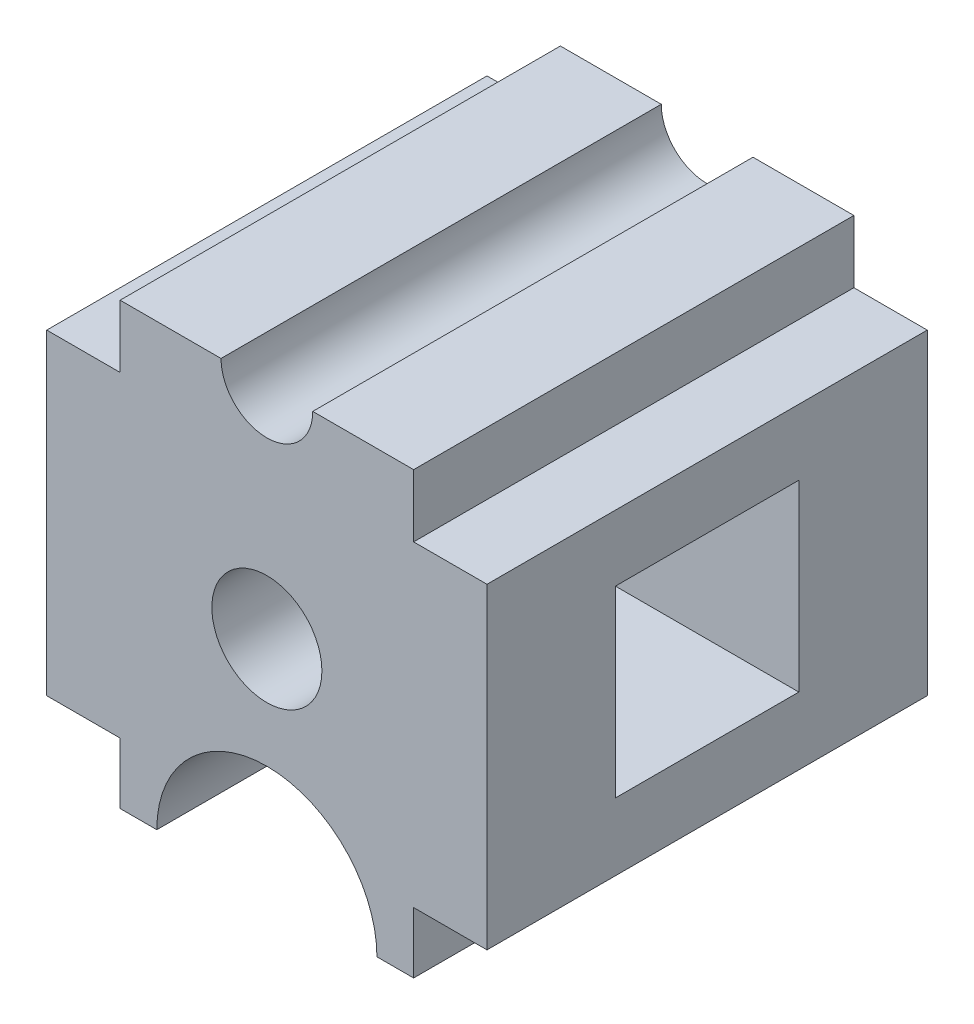
ISO-10303-21;
HEADER;
FILE_DESCRIPTION(('STEP AP214'),'2;1');
FILE_NAME('part.step','',(''),(''),'','','');
FILE_SCHEMA(('AUTOMOTIVE_DESIGN { 1 0 10303 214 1 1 1 1 }'));
ENDSEC;
DATA;
#1=APPLICATION_CONTEXT('core data for automotive mechanical design processes');
#2=APPLICATION_PROTOCOL_DEFINITION('international standard','automotive_design',2000,#1);
#3=PRODUCT_CONTEXT('',#1,'mechanical');
#4=PRODUCT('Part','Part','',(#3));
#5=PRODUCT_RELATED_PRODUCT_CATEGORY('part','',(#4));
#6=PRODUCT_DEFINITION_FORMATION('','',#4);
#7=PRODUCT_DEFINITION_CONTEXT('part definition',#1,'design');
#8=PRODUCT_DEFINITION('design','',#6,#7);
#9=PRODUCT_DEFINITION_SHAPE('','',#8);
#10=(LENGTH_UNIT() NAMED_UNIT(*) SI_UNIT(.MILLI.,.METRE.));
#11=(NAMED_UNIT(*) PLANE_ANGLE_UNIT() SI_UNIT($,.RADIAN.));
#12=(NAMED_UNIT(*) SI_UNIT($,.STERADIAN.) SOLID_ANGLE_UNIT());
#13=UNCERTAINTY_MEASURE_WITH_UNIT(LENGTH_MEASURE(1.E-05),#10,'distance_accuracy_value','');
#14=(GEOMETRIC_REPRESENTATION_CONTEXT(3) GLOBAL_UNCERTAINTY_ASSIGNED_CONTEXT((#13)) GLOBAL_UNIT_ASSIGNED_CONTEXT((#10,
#11,#12)) REPRESENTATION_CONTEXT('',''));
#15=CARTESIAN_POINT('',(0.,0.,0.));
#16=DIRECTION('',(0.,0.,1.));
#17=DIRECTION('',(1.,0.,0.));
#18=AXIS2_PLACEMENT_3D('',#15,#16,#17);
#19=CARTESIAN_POINT('',(0.,0.,60.));
#20=DIRECTION('',(0.,0.,-1.));
#21=DIRECTION('',(-1.,0.,0.));
#22=AXIS2_PLACEMENT_3D('',#19,#20,#21);
#23=CYLINDRICAL_SURFACE('',#22,15.);
#24=CARTESIAN_POINT('',(0.,0.,-25.));
#25=DIRECTION('',(0.,0.,-1.));
#26=DIRECTION('',(-1.,0.,0.));
#27=AXIS2_PLACEMENT_3D('',#24,#25,#26);
#28=CIRCLE('',#27,15.);
#29=CARTESIAN_POINT('',(-15.,0.,-25.));
#30=VERTEX_POINT('',#29);
#31=EDGE_CURVE('E37',#30,#30,#28,.T.);
#32=ORIENTED_EDGE('',*,*,#31,.F.);
#33=EDGE_LOOP('',(#32));
#34=FACE_BOUND('',#33,.T.);
#35=CARTESIAN_POINT('',(0.,0.,-60.));
#36=DIRECTION('',(0.,0.,1.));
#37=DIRECTION('',(1.,0.,0.));
#38=AXIS2_PLACEMENT_3D('',#35,#36,#37);
#39=CIRCLE('',#38,15.);
#40=CARTESIAN_POINT('',(15.,0.,-60.));
#41=VERTEX_POINT('',#40);
#42=EDGE_CURVE('E213',#41,#41,#39,.T.);
#43=ORIENTED_EDGE('',*,*,#42,.F.);
#44=EDGE_LOOP('',(#43));
#45=FACE_BOUND('',#44,.T.);
#46=ADVANCED_FACE('F33',(#34,#45),#23,.F.);
#47=CARTESIAN_POINT('',(0.,-60.,60.));
#48=DIRECTION('',(0.,0.,1.));
#49=DIRECTION('',(1.,0.,0.));
#50=AXIS2_PLACEMENT_3D('',#47,#48,#49);
#51=PLANE('',#50);
#52=CARTESIAN_POINT('',(0.,-60.,60.));
#53=DIRECTION('',(0.,0.,-1.));
#54=DIRECTION('',(1.,0.,0.));
#55=AXIS2_PLACEMENT_3D('',#52,#53,#54);
#56=CIRCLE('',#55,30.);
#57=CARTESIAN_POINT('',(-30.,-60.,60.));
#58=VERTEX_POINT('',#57);
#59=CARTESIAN_POINT('',(30.,-60.,60.));
#60=VERTEX_POINT('',#59);
#61=EDGE_CURVE('E216',#58,#60,#56,.T.);
#62=ORIENTED_EDGE('',*,*,#61,.T.);
#63=DIRECTION('',(1.,0.,0.));
#64=VECTOR('',#63,1.);
#65=CARTESIAN_POINT('',(30.,-60.,60.));
#66=LINE('',#65,#64);
#67=CARTESIAN_POINT('',(40.0000000000001,-60.,60.));
#68=VERTEX_POINT('',#67);
#69=EDGE_CURVE('E219',#60,#68,#66,.T.);
#70=ORIENTED_EDGE('',*,*,#69,.T.);
#71=DIRECTION('',(0.,1.,0.));
#72=VECTOR('',#71,1.);
#73=CARTESIAN_POINT('',(40.0000000000001,-60.,60.));
#74=LINE('',#73,#72);
#75=CARTESIAN_POINT('',(40.0000000000001,-43.3694035710161,60.));
#76=VERTEX_POINT('',#75);
#77=EDGE_CURVE('E222',#68,#76,#74,.T.);
#78=ORIENTED_EDGE('',*,*,#77,.T.);
#79=DIRECTION('',(1.,0.,0.));
#80=VECTOR('',#79,1.);
#81=CARTESIAN_POINT('',(40.0000000000001,-43.3694035710161,60.));
#82=LINE('',#81,#80);
#83=CARTESIAN_POINT('',(60.,-43.3694035710161,60.));
#84=VERTEX_POINT('',#83);
#85=EDGE_CURVE('E224',#76,#84,#82,.T.);
#86=ORIENTED_EDGE('',*,*,#85,.T.);
#87=DIRECTION('',(0.,1.,0.));
#88=VECTOR('',#87,1.);
#89=CARTESIAN_POINT('',(60.,-43.3694035710161,60.));
#90=LINE('',#89,#88);
#91=CARTESIAN_POINT('',(60.,42.9425776749978,60.));
#92=VERTEX_POINT('',#91);
#93=EDGE_CURVE('E226',#84,#92,#90,.T.);
#94=ORIENTED_EDGE('',*,*,#93,.T.);
#95=DIRECTION('',(-1.,0.,0.));
#96=VECTOR('',#95,1.);
#97=CARTESIAN_POINT('',(60.,42.9425776749978,60.));
#98=LINE('',#97,#96);
#99=CARTESIAN_POINT('',(40.,42.9425776749978,60.));
#100=VERTEX_POINT('',#99);
#101=EDGE_CURVE('E228',#92,#100,#98,.T.);
#102=ORIENTED_EDGE('',*,*,#101,.T.);
#103=DIRECTION('',(0.,1.,0.));
#104=VECTOR('',#103,1.);
#105=CARTESIAN_POINT('',(40.,42.9425776749978,60.));
#106=LINE('',#105,#104);
#107=CARTESIAN_POINT('',(40.,60.,60.));
#108=VERTEX_POINT('',#107);
#109=EDGE_CURVE('E230',#100,#108,#106,.T.);
#110=ORIENTED_EDGE('',*,*,#109,.T.);
#111=DIRECTION('',(-1.,0.,0.));
#112=VECTOR('',#111,1.);
#113=CARTESIAN_POINT('',(40.,60.,60.));
#114=LINE('',#113,#112);
#115=CARTESIAN_POINT('',(12.5,60.,60.));
#116=VERTEX_POINT('',#115);
#117=EDGE_CURVE('E232',#108,#116,#114,.T.);
#118=ORIENTED_EDGE('',*,*,#117,.T.);
#119=CARTESIAN_POINT('',(0.,60.,60.));
#120=DIRECTION('',(0.,0.,-1.));
#121=DIRECTION('',(1.,0.,0.));
#122=AXIS2_PLACEMENT_3D('',#119,#120,#121);
#123=CIRCLE('',#122,12.5);
#124=CARTESIAN_POINT('',(-12.5,60.,60.));
#125=VERTEX_POINT('',#124);
#126=EDGE_CURVE('E234',#116,#125,#123,.T.);
#127=ORIENTED_EDGE('',*,*,#126,.T.);
#128=DIRECTION('',(-1.,0.,0.));
#129=VECTOR('',#128,1.);
#130=CARTESIAN_POINT('',(-12.5,60.,60.));
#131=LINE('',#130,#129);
#132=CARTESIAN_POINT('',(-40.,60.,60.));
#133=VERTEX_POINT('',#132);
#134=EDGE_CURVE('E236',#125,#133,#131,.T.);
#135=ORIENTED_EDGE('',*,*,#134,.T.);
#136=DIRECTION('',(0.,-1.,0.));
#137=VECTOR('',#136,1.);
#138=CARTESIAN_POINT('',(-40.,60.,60.));
#139=LINE('',#138,#137);
#140=CARTESIAN_POINT('',(-40.,42.9425776749978,60.));
#141=VERTEX_POINT('',#140);
#142=EDGE_CURVE('E238',#133,#141,#139,.T.);
#143=ORIENTED_EDGE('',*,*,#142,.T.);
#144=DIRECTION('',(-1.,0.,0.));
#145=VECTOR('',#144,1.);
#146=CARTESIAN_POINT('',(-40.,42.9425776749978,60.));
#147=LINE('',#146,#145);
#148=CARTESIAN_POINT('',(-60.,42.9425776749978,60.));
#149=VERTEX_POINT('',#148);
#150=EDGE_CURVE('E240',#141,#149,#147,.T.);
#151=ORIENTED_EDGE('',*,*,#150,.T.);
#152=DIRECTION('',(0.,-1.,0.));
#153=VECTOR('',#152,1.);
#154=CARTESIAN_POINT('',(-60.,42.9425776749978,60.));
#155=LINE('',#154,#153);
#156=CARTESIAN_POINT('',(-60.,-43.3694035710161,60.));
#157=VERTEX_POINT('',#156);
#158=EDGE_CURVE('E242',#149,#157,#155,.T.);
#159=ORIENTED_EDGE('',*,*,#158,.T.);
#160=DIRECTION('',(1.,0.,0.));
#161=VECTOR('',#160,1.);
#162=CARTESIAN_POINT('',(-60.,-43.3694035710161,60.));
#163=LINE('',#162,#161);
#164=CARTESIAN_POINT('',(-40.,-43.3694035710161,60.));
#165=VERTEX_POINT('',#164);
#166=EDGE_CURVE('E244',#157,#165,#163,.T.);
#167=ORIENTED_EDGE('',*,*,#166,.T.);
#168=DIRECTION('',(0.,-1.,0.));
#169=VECTOR('',#168,1.);
#170=CARTESIAN_POINT('',(-40.,-43.3694035710161,60.));
#171=LINE('',#170,#169);
#172=CARTESIAN_POINT('',(-40.,-60.,60.));
#173=VERTEX_POINT('',#172);
#174=EDGE_CURVE('E246',#165,#173,#171,.T.);
#175=ORIENTED_EDGE('',*,*,#174,.T.);
#176=DIRECTION('',(1.,0.,0.));
#177=VECTOR('',#176,1.);
#178=CARTESIAN_POINT('',(-40.,-60.,60.));
#179=LINE('',#178,#177);
#180=EDGE_CURVE('E248',#173,#58,#179,.T.);
#181=ORIENTED_EDGE('',*,*,#180,.T.);
#182=EDGE_LOOP('',(#62,#70,#78,#86,#94,#102,#110,#118,#127,#135,#143,#151,#159,#167,#175,#181));
#183=FACE_BOUND('',#182,.T.);
#184=CARTESIAN_POINT('',(0.,0.,60.));
#185=DIRECTION('',(0.,0.,1.));
#186=DIRECTION('',(1.,0.,0.));
#187=AXIS2_PLACEMENT_3D('',#184,#185,#186);
#188=CIRCLE('',#187,15.);
#189=CARTESIAN_POINT('',(15.,0.,60.));
#190=VERTEX_POINT('',#189);
#191=EDGE_CURVE('E209',#190,#190,#188,.T.);
#192=ORIENTED_EDGE('',*,*,#191,.F.);
#193=EDGE_LOOP('',(#192));
#194=FACE_BOUND('',#193,.T.);
#195=ADVANCED_FACE('F334',(#183,#194),#51,.T.);
#196=CARTESIAN_POINT('',(0.,-60.,-60.));
#197=DIRECTION('',(0.,0.,1.));
#198=DIRECTION('',(1.,0.,0.));
#199=AXIS2_PLACEMENT_3D('',#196,#197,#198);
#200=PLANE('',#199);
#201=CARTESIAN_POINT('',(0.,-60.,-60.));
#202=DIRECTION('',(0.,0.,-1.));
#203=DIRECTION('',(1.,0.,0.));
#204=AXIS2_PLACEMENT_3D('',#201,#202,#203);
#205=CIRCLE('',#204,30.);
#206=CARTESIAN_POINT('',(-30.,-60.,-60.));
#207=VERTEX_POINT('',#206);
#208=CARTESIAN_POINT('',(30.,-60.,-60.));
#209=VERTEX_POINT('',#208);
#210=EDGE_CURVE('E212',#207,#209,#205,.T.);
#211=ORIENTED_EDGE('',*,*,#210,.F.);
#212=DIRECTION('',(1.,0.,0.));
#213=VECTOR('',#212,1.);
#214=CARTESIAN_POINT('',(-40.,-60.,-60.));
#215=LINE('',#214,#213);
#216=CARTESIAN_POINT('',(-40.,-60.,-60.));
#217=VERTEX_POINT('',#216);
#218=EDGE_CURVE('E220',#217,#207,#215,.T.);
#219=ORIENTED_EDGE('',*,*,#218,.F.);
#220=DIRECTION('',(0.,-1.,0.));
#221=VECTOR('',#220,1.);
#222=CARTESIAN_POINT('',(-40.,-43.3694035710161,-60.));
#223=LINE('',#222,#221);
#224=CARTESIAN_POINT('',(-40.,-43.3694035710161,-60.));
#225=VERTEX_POINT('',#224);
#226=EDGE_CURVE('E280',#225,#217,#223,.T.);
#227=ORIENTED_EDGE('',*,*,#226,.F.);
#228=DIRECTION('',(1.,0.,0.));
#229=VECTOR('',#228,1.);
#230=CARTESIAN_POINT('',(-60.,-43.3694035710161,-60.));
#231=LINE('',#230,#229);
#232=CARTESIAN_POINT('',(-60.,-43.3694035710161,-60.));
#233=VERTEX_POINT('',#232);
#234=EDGE_CURVE('E278',#233,#225,#231,.T.);
#235=ORIENTED_EDGE('',*,*,#234,.F.);
#236=DIRECTION('',(0.,-1.,0.));
#237=VECTOR('',#236,1.);
#238=CARTESIAN_POINT('',(-60.,0.,-60.));
#239=LINE('',#238,#237);
#240=CARTESIAN_POINT('',(-60.,42.9425776749978,-60.));
#241=VERTEX_POINT('',#240);
#242=EDGE_CURVE('E276',#241,#233,#239,.T.);
#243=ORIENTED_EDGE('',*,*,#242,.F.);
#244=DIRECTION('',(-1.,0.,0.));
#245=VECTOR('',#244,1.);
#246=CARTESIAN_POINT('',(-40.,42.9425776749978,-60.));
#247=LINE('',#246,#245);
#248=CARTESIAN_POINT('',(-40.,42.9425776749978,-60.));
#249=VERTEX_POINT('',#248);
#250=EDGE_CURVE('E273',#249,#241,#247,.T.);
#251=ORIENTED_EDGE('',*,*,#250,.F.);
#252=DIRECTION('',(0.,-1.,0.));
#253=VECTOR('',#252,1.);
#254=CARTESIAN_POINT('',(-40.,60.,-60.));
#255=LINE('',#254,#253);
#256=CARTESIAN_POINT('',(-40.,60.,-60.));
#257=VERTEX_POINT('',#256);
#258=EDGE_CURVE('E271',#257,#249,#255,.T.);
#259=ORIENTED_EDGE('',*,*,#258,.F.);
#260=DIRECTION('',(-1.,0.,0.));
#261=VECTOR('',#260,1.);
#262=CARTESIAN_POINT('',(-12.5,60.,-60.));
#263=LINE('',#262,#261);
#264=CARTESIAN_POINT('',(-12.5,60.,-60.));
#265=VERTEX_POINT('',#264);
#266=EDGE_CURVE('E269',#265,#257,#263,.T.);
#267=ORIENTED_EDGE('',*,*,#266,.F.);
#268=CARTESIAN_POINT('',(0.,60.,-60.));
#269=DIRECTION('',(0.,0.,-1.));
#270=DIRECTION('',(1.,0.,0.));
#271=AXIS2_PLACEMENT_3D('',#268,#269,#270);
#272=CIRCLE('',#271,12.5);
#273=CARTESIAN_POINT('',(12.5,60.,-60.));
#274=VERTEX_POINT('',#273);
#275=EDGE_CURVE('E267',#274,#265,#272,.T.);
#276=ORIENTED_EDGE('',*,*,#275,.F.);
#277=DIRECTION('',(-1.,0.,0.));
#278=VECTOR('',#277,1.);
#279=CARTESIAN_POINT('',(40.,60.,-60.));
#280=LINE('',#279,#278);
#281=CARTESIAN_POINT('',(40.,60.,-60.));
#282=VERTEX_POINT('',#281);
#283=EDGE_CURVE('E265',#282,#274,#280,.T.);
#284=ORIENTED_EDGE('',*,*,#283,.F.);
#285=DIRECTION('',(0.,1.,0.));
#286=VECTOR('',#285,1.);
#287=CARTESIAN_POINT('',(40.,42.9425776749978,-60.));
#288=LINE('',#287,#286);
#289=CARTESIAN_POINT('',(40.,42.9425776749978,-60.));
#290=VERTEX_POINT('',#289);
#291=EDGE_CURVE('E263',#290,#282,#288,.T.);
#292=ORIENTED_EDGE('',*,*,#291,.F.);
#293=DIRECTION('',(-1.,0.,0.));
#294=VECTOR('',#293,1.);
#295=CARTESIAN_POINT('',(60.,42.9425776749978,-60.));
#296=LINE('',#295,#294);
#297=CARTESIAN_POINT('',(60.,42.9425776749978,-60.));
#298=VERTEX_POINT('',#297);
#299=EDGE_CURVE('E261',#298,#290,#296,.T.);
#300=ORIENTED_EDGE('',*,*,#299,.F.);
#301=DIRECTION('',(0.,1.,0.));
#302=VECTOR('',#301,1.);
#303=CARTESIAN_POINT('',(60.,-43.3694035710161,-60.));
#304=LINE('',#303,#302);
#305=CARTESIAN_POINT('',(60.,-43.3694035710161,-60.));
#306=VERTEX_POINT('',#305);
#307=EDGE_CURVE('E259',#306,#298,#304,.T.);
#308=ORIENTED_EDGE('',*,*,#307,.F.);
#309=DIRECTION('',(1.,0.,0.));
#310=VECTOR('',#309,1.);
#311=CARTESIAN_POINT('',(40.0000000000001,-43.3694035710161,-60.));
#312=LINE('',#311,#310);
#313=CARTESIAN_POINT('',(40.0000000000001,-43.3694035710161,-60.));
#314=VERTEX_POINT('',#313);
#315=EDGE_CURVE('E257',#314,#306,#312,.T.);
#316=ORIENTED_EDGE('',*,*,#315,.F.);
#317=DIRECTION('',(0.,1.,0.));
#318=VECTOR('',#317,1.);
#319=CARTESIAN_POINT('',(40.0000000000001,-60.,-60.));
#320=LINE('',#319,#318);
#321=CARTESIAN_POINT('',(40.0000000000001,-60.,-60.));
#322=VERTEX_POINT('',#321);
#323=EDGE_CURVE('E255',#322,#314,#320,.T.);
#324=ORIENTED_EDGE('',*,*,#323,.F.);
#325=DIRECTION('',(1.,0.,0.));
#326=VECTOR('',#325,1.);
#327=CARTESIAN_POINT('',(30.,-60.,-60.));
#328=LINE('',#327,#326);
#329=EDGE_CURVE('E253',#209,#322,#328,.T.);
#330=ORIENTED_EDGE('',*,*,#329,.F.);
#331=EDGE_LOOP('',(#211,#219,#227,#235,#243,#251,#259,#267,#276,#284,#292,#300,#308,#316,#324,#330));
#332=FACE_BOUND('',#331,.T.);
#333=ORIENTED_EDGE('',*,*,#42,.T.);
#334=EDGE_LOOP('',(#333));
#335=FACE_BOUND('',#334,.T.);
#336=ADVANCED_FACE('F339',(#332,#335),#200,.F.);
#337=CARTESIAN_POINT('',(0.,-60.,60.));
#338=DIRECTION('',(0.,0.,-1.));
#339=DIRECTION('',(-1.,0.,0.));
#340=AXIS2_PLACEMENT_3D('',#337,#338,#339);
#341=CYLINDRICAL_SURFACE('',#340,30.);
#342=ORIENTED_EDGE('',*,*,#210,.T.);
#343=DIRECTION('',(0.,0.,-1.));
#344=VECTOR('',#343,1.);
#345=CARTESIAN_POINT('',(30.,-60.,60.));
#346=LINE('',#345,#344);
#347=EDGE_CURVE('E11',#60,#209,#346,.T.);
#348=ORIENTED_EDGE('',*,*,#347,.F.);
#349=ORIENTED_EDGE('',*,*,#61,.F.);
#350=DIRECTION('',(0.,0.,-1.));
#351=VECTOR('',#350,1.);
#352=CARTESIAN_POINT('',(-30.,-60.,60.));
#353=LINE('',#352,#351);
#354=EDGE_CURVE('E250',#58,#207,#353,.T.);
#355=ORIENTED_EDGE('',*,*,#354,.T.);
#356=EDGE_LOOP('',(#342,#348,#349,#355));
#357=FACE_BOUND('',#356,.T.);
#358=ADVANCED_FACE('F35',(#357),#341,.F.);
#359=CARTESIAN_POINT('',(30.,-60.,60.));
#360=DIRECTION('',(0.,1.,0.));
#361=DIRECTION('',(0.,0.,1.));
#362=AXIS2_PLACEMENT_3D('',#359,#360,#361);
#363=PLANE('',#362);
#364=ORIENTED_EDGE('',*,*,#329,.T.);
#365=DIRECTION('',(0.,0.,-1.));
#366=VECTOR('',#365,1.);
#367=CARTESIAN_POINT('',(40.0000000000001,-60.,60.));
#368=LINE('',#367,#366);
#369=EDGE_CURVE('E42',#68,#322,#368,.T.);
#370=ORIENTED_EDGE('',*,*,#369,.F.);
#371=ORIENTED_EDGE('',*,*,#69,.F.);
#372=ORIENTED_EDGE('',*,*,#347,.T.);
#373=EDGE_LOOP('',(#364,#370,#371,#372));
#374=FACE_BOUND('',#373,.T.);
#375=ADVANCED_FACE('F347',(#374),#363,.F.);
#376=CARTESIAN_POINT('',(40.0000000000001,-60.,60.));
#377=DIRECTION('',(-1.,0.,0.));
#378=DIRECTION('',(0.,0.,1.));
#379=AXIS2_PLACEMENT_3D('',#376,#377,#378);
#380=PLANE('',#379);
#381=ORIENTED_EDGE('',*,*,#323,.T.);
#382=DIRECTION('',(0.,0.,-1.));
#383=VECTOR('',#382,1.);
#384=CARTESIAN_POINT('',(40.0000000000001,-43.3694035710161,60.));
#385=LINE('',#384,#383);
#386=EDGE_CURVE('E321',#76,#314,#385,.T.);
#387=ORIENTED_EDGE('',*,*,#386,.F.);
#388=ORIENTED_EDGE('',*,*,#77,.F.);
#389=ORIENTED_EDGE('',*,*,#369,.T.);
#390=EDGE_LOOP('',(#381,#387,#388,#389));
#391=FACE_BOUND('',#390,.T.);
#392=ADVANCED_FACE('F402',(#391),#380,.F.);
#393=CARTESIAN_POINT('',(40.0000000000001,-43.3694035710161,60.));
#394=DIRECTION('',(0.,1.,0.));
#395=DIRECTION('',(0.,0.,1.));
#396=AXIS2_PLACEMENT_3D('',#393,#394,#395);
#397=PLANE('',#396);
#398=ORIENTED_EDGE('',*,*,#315,.T.);
#399=DIRECTION('',(0.,0.,-1.));
#400=VECTOR('',#399,1.);
#401=CARTESIAN_POINT('',(60.,-43.3694035710161,60.));
#402=LINE('',#401,#400);
#403=EDGE_CURVE('E318',#84,#306,#402,.T.);
#404=ORIENTED_EDGE('',*,*,#403,.F.);
#405=ORIENTED_EDGE('',*,*,#85,.F.);
#406=ORIENTED_EDGE('',*,*,#386,.T.);
#407=EDGE_LOOP('',(#398,#404,#405,#406));
#408=FACE_BOUND('',#407,.T.);
#409=ADVANCED_FACE('F398',(#408),#397,.F.);
#410=CARTESIAN_POINT('',(60.,-43.3694035710161,60.));
#411=DIRECTION('',(-1.,0.,0.));
#412=DIRECTION('',(0.,0.,1.));
#413=AXIS2_PLACEMENT_3D('',#410,#411,#412);
#414=PLANE('',#413);
#415=DIRECTION('',(0.,0.,1.));
#416=VECTOR('',#415,1.);
#417=CARTESIAN_POINT('',(60.,25.,25.));
#418=LINE('',#417,#416);
#419=CARTESIAN_POINT('',(60.,25.,-25.));
#420=VERTEX_POINT('',#419);
#421=CARTESIAN_POINT('',(60.,25.,25.));
#422=VERTEX_POINT('',#421);
#423=EDGE_CURVE('E199',#420,#422,#418,.T.);
#424=ORIENTED_EDGE('',*,*,#423,.F.);
#425=DIRECTION('',(0.,1.,0.));
#426=VECTOR('',#425,1.);
#427=CARTESIAN_POINT('',(60.,25.,-25.));
#428=LINE('',#427,#426);
#429=CARTESIAN_POINT('',(60.,-25.,-25.));
#430=VERTEX_POINT('',#429);
#431=EDGE_CURVE('E50',#430,#420,#428,.T.);
#432=ORIENTED_EDGE('',*,*,#431,.F.);
#433=DIRECTION('',(0.,0.,-1.));
#434=VECTOR('',#433,1.);
#435=CARTESIAN_POINT('',(60.,-25.,25.));
#436=LINE('',#435,#434);
#437=CARTESIAN_POINT('',(60.,-25.,25.));
#438=VERTEX_POINT('',#437);
#439=EDGE_CURVE('E190',#438,#430,#436,.T.);
#440=ORIENTED_EDGE('',*,*,#439,.F.);
#441=DIRECTION('',(0.,-1.,0.));
#442=VECTOR('',#441,1.);
#443=CARTESIAN_POINT('',(60.,25.,25.));
#444=LINE('',#443,#442);
#445=EDGE_CURVE('E193',#422,#438,#444,.T.);
#446=ORIENTED_EDGE('',*,*,#445,.F.);
#447=EDGE_LOOP('',(#424,#432,#440,#446));
#448=FACE_BOUND('',#447,.T.);
#449=ORIENTED_EDGE('',*,*,#307,.T.);
#450=DIRECTION('',(0.,0.,-1.));
#451=VECTOR('',#450,1.);
#452=CARTESIAN_POINT('',(60.,42.9425776749978,60.));
#453=LINE('',#452,#451);
#454=EDGE_CURVE('E315',#92,#298,#453,.T.);
#455=ORIENTED_EDGE('',*,*,#454,.F.);
#456=ORIENTED_EDGE('',*,*,#93,.F.);
#457=ORIENTED_EDGE('',*,*,#403,.T.);
#458=EDGE_LOOP('',(#449,#455,#456,#457));
#459=FACE_BOUND('',#458,.T.);
#460=ADVANCED_FACE('F394',(#448,#459),#414,.F.);
#461=CARTESIAN_POINT('',(60.,42.9425776749978,60.));
#462=DIRECTION('',(0.,-1.,0.));
#463=DIRECTION('',(0.,0.,-1.));
#464=AXIS2_PLACEMENT_3D('',#461,#462,#463);
#465=PLANE('',#464);
#466=ORIENTED_EDGE('',*,*,#299,.T.);
#467=DIRECTION('',(0.,0.,-1.));
#468=VECTOR('',#467,1.);
#469=CARTESIAN_POINT('',(40.,42.9425776749978,60.));
#470=LINE('',#469,#468);
#471=EDGE_CURVE('E312',#100,#290,#470,.T.);
#472=ORIENTED_EDGE('',*,*,#471,.F.);
#473=ORIENTED_EDGE('',*,*,#101,.F.);
#474=ORIENTED_EDGE('',*,*,#454,.T.);
#475=EDGE_LOOP('',(#466,#472,#473,#474));
#476=FACE_BOUND('',#475,.T.);
#477=ADVANCED_FACE('F390',(#476),#465,.F.);
#478=CARTESIAN_POINT('',(40.,42.9425776749978,60.));
#479=DIRECTION('',(-1.,0.,0.));
#480=DIRECTION('',(0.,0.,1.));
#481=AXIS2_PLACEMENT_3D('',#478,#479,#480);
#482=PLANE('',#481);
#483=ORIENTED_EDGE('',*,*,#291,.T.);
#484=DIRECTION('',(0.,0.,-1.));
#485=VECTOR('',#484,1.);
#486=CARTESIAN_POINT('',(40.,60.,60.));
#487=LINE('',#486,#485);
#488=EDGE_CURVE('E309',#108,#282,#487,.T.);
#489=ORIENTED_EDGE('',*,*,#488,.F.);
#490=ORIENTED_EDGE('',*,*,#109,.F.);
#491=ORIENTED_EDGE('',*,*,#471,.T.);
#492=EDGE_LOOP('',(#483,#489,#490,#491));
#493=FACE_BOUND('',#492,.T.);
#494=ADVANCED_FACE('F386',(#493),#482,.F.);
#495=CARTESIAN_POINT('',(40.,60.,60.));
#496=DIRECTION('',(0.,-1.,0.));
#497=DIRECTION('',(0.,0.,-1.));
#498=AXIS2_PLACEMENT_3D('',#495,#496,#497);
#499=PLANE('',#498);
#500=ORIENTED_EDGE('',*,*,#283,.T.);
#501=DIRECTION('',(0.,0.,-1.));
#502=VECTOR('',#501,1.);
#503=CARTESIAN_POINT('',(12.5,60.,60.));
#504=LINE('',#503,#502);
#505=EDGE_CURVE('E306',#116,#274,#504,.T.);
#506=ORIENTED_EDGE('',*,*,#505,.F.);
#507=ORIENTED_EDGE('',*,*,#117,.F.);
#508=ORIENTED_EDGE('',*,*,#488,.T.);
#509=EDGE_LOOP('',(#500,#506,#507,#508));
#510=FACE_BOUND('',#509,.T.);
#511=ADVANCED_FACE('F382',(#510),#499,.F.);
#512=CARTESIAN_POINT('',(0.,60.,60.));
#513=DIRECTION('',(0.,0.,-1.));
#514=DIRECTION('',(-1.,0.,0.));
#515=AXIS2_PLACEMENT_3D('',#512,#513,#514);
#516=CYLINDRICAL_SURFACE('',#515,12.5);
#517=ORIENTED_EDGE('',*,*,#275,.T.);
#518=DIRECTION('',(0.,0.,-1.));
#519=VECTOR('',#518,1.);
#520=CARTESIAN_POINT('',(-12.5,60.,60.));
#521=LINE('',#520,#519);
#522=EDGE_CURVE('E303',#125,#265,#521,.T.);
#523=ORIENTED_EDGE('',*,*,#522,.F.);
#524=ORIENTED_EDGE('',*,*,#126,.F.);
#525=ORIENTED_EDGE('',*,*,#505,.T.);
#526=EDGE_LOOP('',(#517,#523,#524,#525));
#527=FACE_BOUND('',#526,.T.);
#528=ADVANCED_FACE('F378',(#527),#516,.F.);
#529=CARTESIAN_POINT('',(-12.5,60.,60.));
#530=DIRECTION('',(0.,-1.,0.));
#531=DIRECTION('',(0.,0.,-1.));
#532=AXIS2_PLACEMENT_3D('',#529,#530,#531);
#533=PLANE('',#532);
#534=ORIENTED_EDGE('',*,*,#266,.T.);
#535=DIRECTION('',(0.,0.,-1.));
#536=VECTOR('',#535,1.);
#537=CARTESIAN_POINT('',(-40.,60.,60.));
#538=LINE('',#537,#536);
#539=EDGE_CURVE('E300',#133,#257,#538,.T.);
#540=ORIENTED_EDGE('',*,*,#539,.F.);
#541=ORIENTED_EDGE('',*,*,#134,.F.);
#542=ORIENTED_EDGE('',*,*,#522,.T.);
#543=EDGE_LOOP('',(#534,#540,#541,#542));
#544=FACE_BOUND('',#543,.T.);
#545=ADVANCED_FACE('F374',(#544),#533,.F.);
#546=CARTESIAN_POINT('',(-40.,60.,60.));
#547=DIRECTION('',(1.,0.,0.));
#548=DIRECTION('',(0.,1.,0.));
#549=AXIS2_PLACEMENT_3D('',#546,#547,#548);
#550=PLANE('',#549);
#551=ORIENTED_EDGE('',*,*,#258,.T.);
#552=DIRECTION('',(0.,0.,-1.));
#553=VECTOR('',#552,1.);
#554=CARTESIAN_POINT('',(-40.,42.9425776749978,60.));
#555=LINE('',#554,#553);
#556=EDGE_CURVE('E297',#141,#249,#555,.T.);
#557=ORIENTED_EDGE('',*,*,#556,.F.);
#558=ORIENTED_EDGE('',*,*,#142,.F.);
#559=ORIENTED_EDGE('',*,*,#539,.T.);
#560=EDGE_LOOP('',(#551,#557,#558,#559));
#561=FACE_BOUND('',#560,.T.);
#562=ADVANCED_FACE('F370',(#561),#550,.F.);
#563=CARTESIAN_POINT('',(-40.,42.9425776749978,60.));
#564=DIRECTION('',(0.,-1.,0.));
#565=DIRECTION('',(0.,0.,-1.));
#566=AXIS2_PLACEMENT_3D('',#563,#564,#565);
#567=PLANE('',#566);
#568=ORIENTED_EDGE('',*,*,#250,.T.);
#569=DIRECTION('',(0.,0.,-1.));
#570=VECTOR('',#569,1.);
#571=CARTESIAN_POINT('',(-60.,42.9425776749978,60.));
#572=LINE('',#571,#570);
#573=EDGE_CURVE('E294',#149,#241,#572,.T.);
#574=ORIENTED_EDGE('',*,*,#573,.F.);
#575=ORIENTED_EDGE('',*,*,#150,.F.);
#576=ORIENTED_EDGE('',*,*,#556,.T.);
#577=EDGE_LOOP('',(#568,#574,#575,#576));
#578=FACE_BOUND('',#577,.T.);
#579=ADVANCED_FACE('F367',(#578),#567,.F.);
#580=CARTESIAN_POINT('',(-60.,0.,60.));
#581=DIRECTION('',(1.,0.,0.));
#582=DIRECTION('',(0.,0.,-1.));
#583=AXIS2_PLACEMENT_3D('',#580,#581,#582);
#584=PLANE('',#583);
#585=DIRECTION('',(0.,0.,-1.));
#586=VECTOR('',#585,1.);
#587=CARTESIAN_POINT('',(-60.,-25.,25.));
#588=LINE('',#587,#586);
#589=CARTESIAN_POINT('',(-60.,-25.,25.));
#590=VERTEX_POINT('',#589);
#591=CARTESIAN_POINT('',(-60.,-25.,-25.));
#592=VERTEX_POINT('',#591);
#593=EDGE_CURVE('E180',#590,#592,#588,.T.);
#594=ORIENTED_EDGE('',*,*,#593,.T.);
#595=DIRECTION('',(0.,1.,0.));
#596=VECTOR('',#595,1.);
#597=CARTESIAN_POINT('',(-60.,25.,-25.));
#598=LINE('',#597,#596);
#599=CARTESIAN_POINT('',(-60.,25.,-25.));
#600=VERTEX_POINT('',#599);
#601=EDGE_CURVE('E174',#592,#600,#598,.T.);
#602=ORIENTED_EDGE('',*,*,#601,.T.);
#603=DIRECTION('',(0.,0.,1.));
#604=VECTOR('',#603,1.);
#605=CARTESIAN_POINT('',(-60.,25.,25.));
#606=LINE('',#605,#604);
#607=CARTESIAN_POINT('',(-60.,25.,25.));
#608=VERTEX_POINT('',#607);
#609=EDGE_CURVE('E183',#600,#608,#606,.T.);
#610=ORIENTED_EDGE('',*,*,#609,.T.);
#611=DIRECTION('',(0.,-1.,0.));
#612=VECTOR('',#611,1.);
#613=CARTESIAN_POINT('',(-60.,25.,25.));
#614=LINE('',#613,#612);
#615=EDGE_CURVE('E58',#608,#590,#614,.T.);
#616=ORIENTED_EDGE('',*,*,#615,.T.);
#617=EDGE_LOOP('',(#594,#602,#610,#616));
#618=FACE_BOUND('',#617,.T.);
#619=ORIENTED_EDGE('',*,*,#242,.T.);
#620=DIRECTION('',(0.,0.,-1.));
#621=VECTOR('',#620,1.);
#622=CARTESIAN_POINT('',(-60.,-43.3694035710161,60.));
#623=LINE('',#622,#621);
#624=EDGE_CURVE('E291',#157,#233,#623,.T.);
#625=ORIENTED_EDGE('',*,*,#624,.F.);
#626=ORIENTED_EDGE('',*,*,#158,.F.);
#627=ORIENTED_EDGE('',*,*,#573,.T.);
#628=EDGE_LOOP('',(#619,#625,#626,#627));
#629=FACE_BOUND('',#628,.T.);
#630=ADVANCED_FACE('F187',(#618,#629),#584,.F.);
#631=CARTESIAN_POINT('',(-60.,-43.3694035710161,60.));
#632=DIRECTION('',(0.,1.,0.));
#633=DIRECTION('',(0.,0.,1.));
#634=AXIS2_PLACEMENT_3D('',#631,#632,#633);
#635=PLANE('',#634);
#636=ORIENTED_EDGE('',*,*,#234,.T.);
#637=DIRECTION('',(0.,0.,-1.));
#638=VECTOR('',#637,1.);
#639=CARTESIAN_POINT('',(-40.,-43.3694035710161,60.));
#640=LINE('',#639,#638);
#641=EDGE_CURVE('E288',#165,#225,#640,.T.);
#642=ORIENTED_EDGE('',*,*,#641,.F.);
#643=ORIENTED_EDGE('',*,*,#166,.F.);
#644=ORIENTED_EDGE('',*,*,#624,.T.);
#645=EDGE_LOOP('',(#636,#642,#643,#644));
#646=FACE_BOUND('',#645,.T.);
#647=ADVANCED_FACE('F360',(#646),#635,.F.);
#648=CARTESIAN_POINT('',(-40.,-43.3694035710161,60.));
#649=DIRECTION('',(1.,0.,0.));
#650=DIRECTION('',(0.,0.,-1.));
#651=AXIS2_PLACEMENT_3D('',#648,#649,#650);
#652=PLANE('',#651);
#653=ORIENTED_EDGE('',*,*,#226,.T.);
#654=DIRECTION('',(0.,0.,-1.));
#655=VECTOR('',#654,1.);
#656=CARTESIAN_POINT('',(-40.,-60.,60.));
#657=LINE('',#656,#655);
#658=EDGE_CURVE('E285',#173,#217,#657,.T.);
#659=ORIENTED_EDGE('',*,*,#658,.F.);
#660=ORIENTED_EDGE('',*,*,#174,.F.);
#661=ORIENTED_EDGE('',*,*,#641,.T.);
#662=EDGE_LOOP('',(#653,#659,#660,#661));
#663=FACE_BOUND('',#662,.T.);
#664=ADVANCED_FACE('F356',(#663),#652,.F.);
#665=CARTESIAN_POINT('',(-40.,-60.,60.));
#666=DIRECTION('',(0.,1.,0.));
#667=DIRECTION('',(0.,0.,1.));
#668=AXIS2_PLACEMENT_3D('',#665,#666,#667);
#669=PLANE('',#668);
#670=ORIENTED_EDGE('',*,*,#218,.T.);
#671=ORIENTED_EDGE('',*,*,#354,.F.);
#672=ORIENTED_EDGE('',*,*,#180,.F.);
#673=ORIENTED_EDGE('',*,*,#658,.T.);
#674=EDGE_LOOP('',(#670,#671,#672,#673));
#675=FACE_BOUND('',#674,.T.);
#676=ADVANCED_FACE('F353',(#675),#669,.F.);
#677=CARTESIAN_POINT('',(0.,0.,25.));
#678=DIRECTION('',(0.,0.,1.));
#679=DIRECTION('',(1.,0.,0.));
#680=AXIS2_PLACEMENT_3D('',#677,#678,#679);
#681=CIRCLE('',#680,15.);
#682=CARTESIAN_POINT('',(15.,0.,25.));
#683=VERTEX_POINT('',#682);
#684=EDGE_CURVE('E205',#683,#683,#681,.T.);
#685=ORIENTED_EDGE('',*,*,#684,.F.);
#686=EDGE_LOOP('',(#685));
#687=FACE_BOUND('',#686,.T.);
#688=ORIENTED_EDGE('',*,*,#191,.T.);
#689=EDGE_LOOP('',(#688));
#690=FACE_BOUND('',#689,.T.);
#691=ADVANCED_FACE('F336',(#687,#690),#23,.F.);
#692=CARTESIAN_POINT('',(-60.,25.,-25.));
#693=DIRECTION('',(0.,0.,-1.));
#694=DIRECTION('',(-1.,0.,0.));
#695=AXIS2_PLACEMENT_3D('',#692,#693,#694);
#696=PLANE('',#695);
#697=ORIENTED_EDGE('',*,*,#31,.T.);
#698=EDGE_LOOP('',(#697));
#699=FACE_BOUND('',#698,.T.);
#700=ORIENTED_EDGE('',*,*,#431,.T.);
#701=DIRECTION('',(1.,0.,0.));
#702=VECTOR('',#701,1.);
#703=CARTESIAN_POINT('',(-60.,25.,-25.));
#704=LINE('',#703,#702);
#705=EDGE_CURVE('E170',#600,#420,#704,.T.);
#706=ORIENTED_EDGE('',*,*,#705,.F.);
#707=ORIENTED_EDGE('',*,*,#601,.F.);
#708=DIRECTION('',(1.,0.,0.));
#709=VECTOR('',#708,1.);
#710=CARTESIAN_POINT('',(-60.,-25.,-25.));
#711=LINE('',#710,#709);
#712=EDGE_CURVE('E203',#592,#430,#711,.T.);
#713=ORIENTED_EDGE('',*,*,#712,.T.);
#714=EDGE_LOOP('',(#700,#706,#707,#713));
#715=FACE_BOUND('',#714,.T.);
#716=ADVANCED_FACE('F172',(#699,#715),#696,.F.);
#717=CARTESIAN_POINT('',(-60.,-25.,25.));
#718=DIRECTION('',(0.,-1.,0.));
#719=DIRECTION('',(0.,0.,-1.));
#720=AXIS2_PLACEMENT_3D('',#717,#718,#719);
#721=PLANE('',#720);
#722=ORIENTED_EDGE('',*,*,#439,.T.);
#723=ORIENTED_EDGE('',*,*,#712,.F.);
#724=ORIENTED_EDGE('',*,*,#593,.F.);
#725=DIRECTION('',(1.,0.,0.));
#726=VECTOR('',#725,1.);
#727=CARTESIAN_POINT('',(-60.,-25.,25.));
#728=LINE('',#727,#726);
#729=EDGE_CURVE('E206',#590,#438,#728,.T.);
#730=ORIENTED_EDGE('',*,*,#729,.T.);
#731=EDGE_LOOP('',(#722,#723,#724,#730));
#732=FACE_BOUND('',#731,.T.);
#733=ADVANCED_FACE('F463',(#732),#721,.F.);
#734=CARTESIAN_POINT('',(-60.,25.,25.));
#735=DIRECTION('',(0.,0.,1.));
#736=DIRECTION('',(1.,0.,0.));
#737=AXIS2_PLACEMENT_3D('',#734,#735,#736);
#738=PLANE('',#737);
#739=ORIENTED_EDGE('',*,*,#684,.T.);
#740=EDGE_LOOP('',(#739));
#741=FACE_BOUND('',#740,.T.);
#742=ORIENTED_EDGE('',*,*,#445,.T.);
#743=ORIENTED_EDGE('',*,*,#729,.F.);
#744=ORIENTED_EDGE('',*,*,#615,.F.);
#745=DIRECTION('',(1.,0.,0.));
#746=VECTOR('',#745,1.);
#747=CARTESIAN_POINT('',(-60.,25.,25.));
#748=LINE('',#747,#746);
#749=EDGE_CURVE('E179',#608,#422,#748,.T.);
#750=ORIENTED_EDGE('',*,*,#749,.T.);
#751=EDGE_LOOP('',(#742,#743,#744,#750));
#752=FACE_BOUND('',#751,.T.);
#753=ADVANCED_FACE('F468',(#741,#752),#738,.F.);
#754=CARTESIAN_POINT('',(-60.,25.,25.));
#755=DIRECTION('',(0.,1.,0.));
#756=DIRECTION('',(0.,0.,1.));
#757=AXIS2_PLACEMENT_3D('',#754,#755,#756);
#758=PLANE('',#757);
#759=ORIENTED_EDGE('',*,*,#423,.T.);
#760=ORIENTED_EDGE('',*,*,#749,.F.);
#761=ORIENTED_EDGE('',*,*,#609,.F.);
#762=ORIENTED_EDGE('',*,*,#705,.T.);
#763=EDGE_LOOP('',(#759,#760,#761,#762));
#764=FACE_BOUND('',#763,.T.);
#765=ADVANCED_FACE('F184',(#764),#758,.F.);
#766=CLOSED_SHELL('',(#46,#195,#336,#358,#375,#392,#409,#460,#477,#494,#511,#528,#545,#562,#579,
#630,#647,#664,#676,#691,#716,#733,#753,#765));
#767=MANIFOLD_SOLID_BREP('B2',#766);
#768=ADVANCED_BREP_SHAPE_REPRESENTATION('',(#18,#767),#14);
#769=SHAPE_DEFINITION_REPRESENTATION(#9,#768);
ENDSEC;
END-ISO-10303-21;
